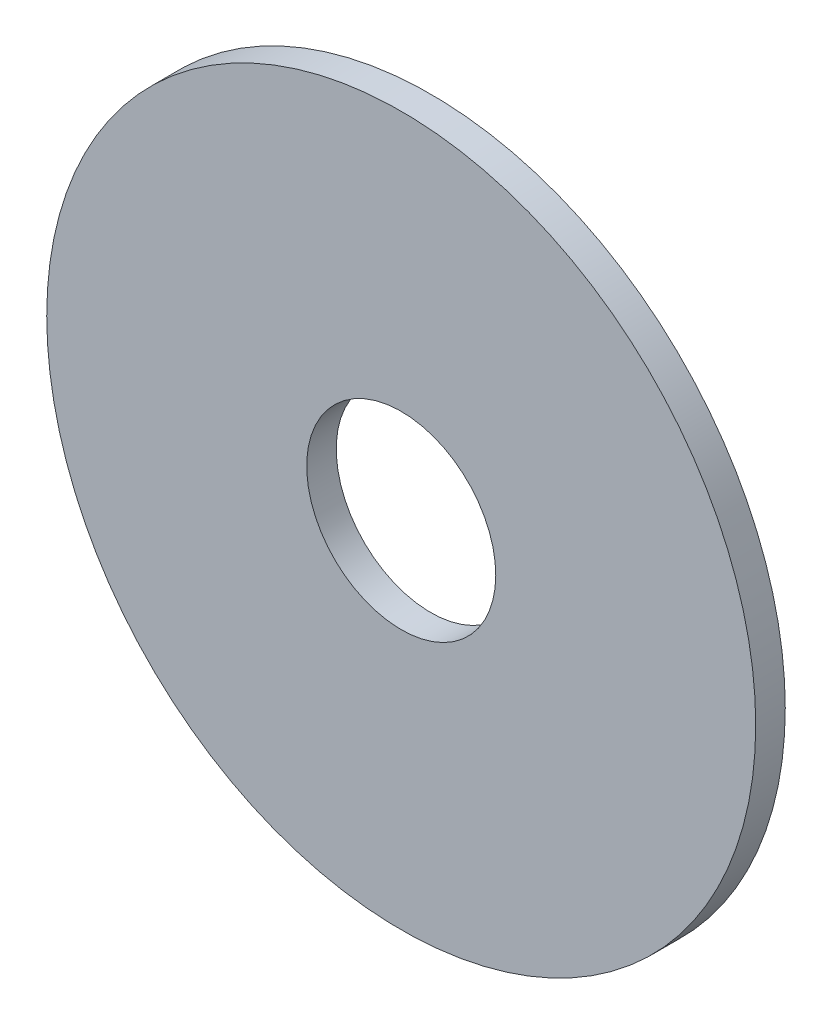
ISO-10303-21;
HEADER;
FILE_DESCRIPTION(('STEP AP214'),'2;1');
FILE_NAME('part.step','',(''),(''),'','','');
FILE_SCHEMA(('AUTOMOTIVE_DESIGN { 1 0 10303 214 1 1 1 1 }'));
ENDSEC;
DATA;
#1=APPLICATION_CONTEXT('core data for automotive mechanical design processes');
#2=APPLICATION_PROTOCOL_DEFINITION('international standard','automotive_design',2000,#1);
#3=PRODUCT_CONTEXT('',#1,'mechanical');
#4=PRODUCT('Part','Part','',(#3));
#5=PRODUCT_RELATED_PRODUCT_CATEGORY('part','',(#4));
#6=PRODUCT_DEFINITION_FORMATION('','',#4);
#7=PRODUCT_DEFINITION_CONTEXT('part definition',#1,'design');
#8=PRODUCT_DEFINITION('design','',#6,#7);
#9=PRODUCT_DEFINITION_SHAPE('','',#8);
#10=(LENGTH_UNIT() NAMED_UNIT(*) SI_UNIT(.MILLI.,.METRE.));
#11=(NAMED_UNIT(*) PLANE_ANGLE_UNIT() SI_UNIT($,.RADIAN.));
#12=(NAMED_UNIT(*) SI_UNIT($,.STERADIAN.) SOLID_ANGLE_UNIT());
#13=UNCERTAINTY_MEASURE_WITH_UNIT(LENGTH_MEASURE(1.E-05),#10,'distance_accuracy_value','');
#14=(GEOMETRIC_REPRESENTATION_CONTEXT(3) GLOBAL_UNCERTAINTY_ASSIGNED_CONTEXT((#13)) GLOBAL_UNIT_ASSIGNED_CONTEXT((#10,
#11,#12)) REPRESENTATION_CONTEXT('',''));
#15=CARTESIAN_POINT('',(0.,0.,0.));
#16=DIRECTION('',(0.,0.,1.));
#17=DIRECTION('',(1.,0.,0.));
#18=AXIS2_PLACEMENT_3D('',#15,#16,#17);
#19=CARTESIAN_POINT('',(0.,0.,0.5));
#20=DIRECTION('',(0.,0.,-1.));
#21=DIRECTION('',(-1.,0.,0.));
#22=AXIS2_PLACEMENT_3D('',#19,#20,#21);
#23=CYLINDRICAL_SURFACE('',#22,6.);
#24=CARTESIAN_POINT('',(0.,0.,0.5));
#25=DIRECTION('',(0.,0.,1.));
#26=DIRECTION('',(1.,0.,0.));
#27=AXIS2_PLACEMENT_3D('',#24,#25,#26);
#28=CIRCLE('',#27,6.);
#29=CARTESIAN_POINT('',(6.,0.,0.5));
#30=VERTEX_POINT('',#29);
#31=EDGE_CURVE('E12',#30,#30,#28,.T.);
#32=ORIENTED_EDGE('',*,*,#31,.F.);
#33=EDGE_LOOP('',(#32));
#34=FACE_BOUND('',#33,.T.);
#35=CARTESIAN_POINT('',(0.,0.,0.));
#36=DIRECTION('',(0.,0.,1.));
#37=DIRECTION('',(1.,0.,0.));
#38=AXIS2_PLACEMENT_3D('',#35,#36,#37);
#39=CIRCLE('',#38,6.);
#40=CARTESIAN_POINT('',(6.,0.,0.));
#41=VERTEX_POINT('',#40);
#42=EDGE_CURVE('E49',#41,#41,#39,.T.);
#43=ORIENTED_EDGE('',*,*,#42,.T.);
#44=EDGE_LOOP('',(#43));
#45=FACE_BOUND('',#44,.T.);
#46=ADVANCED_FACE('F46',(#34,#45),#23,.T.);
#47=CARTESIAN_POINT('',(0.,0.,0.5));
#48=DIRECTION('',(0.,0.,1.));
#49=DIRECTION('',(1.,0.,0.));
#50=AXIS2_PLACEMENT_3D('',#47,#48,#49);
#51=PLANE('',#50);
#52=CARTESIAN_POINT('',(0.,0.,0.5));
#53=DIRECTION('',(0.,0.,1.));
#54=DIRECTION('',(1.,0.,0.));
#55=AXIS2_PLACEMENT_3D('',#52,#53,#54);
#56=CIRCLE('',#55,1.6);
#57=CARTESIAN_POINT('',(1.6,0.,0.5));
#58=VERTEX_POINT('',#57);
#59=EDGE_CURVE('E58',#58,#58,#56,.T.);
#60=ORIENTED_EDGE('',*,*,#59,.F.);
#61=EDGE_LOOP('',(#60));
#62=FACE_BOUND('',#61,.T.);
#63=ORIENTED_EDGE('',*,*,#31,.T.);
#64=EDGE_LOOP('',(#63));
#65=FACE_BOUND('',#64,.T.);
#66=ADVANCED_FACE('F73',(#62,#65),#51,.T.);
#67=CARTESIAN_POINT('',(0.,0.,0.));
#68=DIRECTION('',(0.,0.,1.));
#69=DIRECTION('',(1.,0.,0.));
#70=AXIS2_PLACEMENT_3D('',#67,#68,#69);
#71=PLANE('',#70);
#72=CARTESIAN_POINT('',(0.,0.,0.));
#73=DIRECTION('',(0.,0.,1.));
#74=DIRECTION('',(1.,0.,0.));
#75=AXIS2_PLACEMENT_3D('',#72,#73,#74);
#76=CIRCLE('',#75,1.6);
#77=CARTESIAN_POINT('',(1.6,0.,0.));
#78=VERTEX_POINT('',#77);
#79=EDGE_CURVE('E56',#78,#78,#76,.T.);
#80=ORIENTED_EDGE('',*,*,#79,.T.);
#81=EDGE_LOOP('',(#80));
#82=FACE_BOUND('',#81,.T.);
#83=ORIENTED_EDGE('',*,*,#42,.F.);
#84=EDGE_LOOP('',(#83));
#85=FACE_BOUND('',#84,.T.);
#86=ADVANCED_FACE('F64',(#82,#85),#71,.F.);
#87=CARTESIAN_POINT('',(0.,0.,0.));
#88=DIRECTION('',(0.,0.,1.));
#89=DIRECTION('',(1.,0.,0.));
#90=AXIS2_PLACEMENT_3D('',#87,#88,#89);
#91=CYLINDRICAL_SURFACE('',#90,1.6);
#92=ORIENTED_EDGE('',*,*,#79,.F.);
#93=EDGE_LOOP('',(#92));
#94=FACE_BOUND('',#93,.T.);
#95=ORIENTED_EDGE('',*,*,#59,.T.);
#96=EDGE_LOOP('',(#95));
#97=FACE_BOUND('',#96,.T.);
#98=ADVANCED_FACE('F67',(#94,#97),#91,.F.);
#99=CLOSED_SHELL('',(#46,#66,#86,#98));
#100=MANIFOLD_SOLID_BREP('B2',#99);
#101=ADVANCED_BREP_SHAPE_REPRESENTATION('',(#18,#100),#14);
#102=SHAPE_DEFINITION_REPRESENTATION(#9,#101);
ENDSEC;
END-ISO-10303-21;
